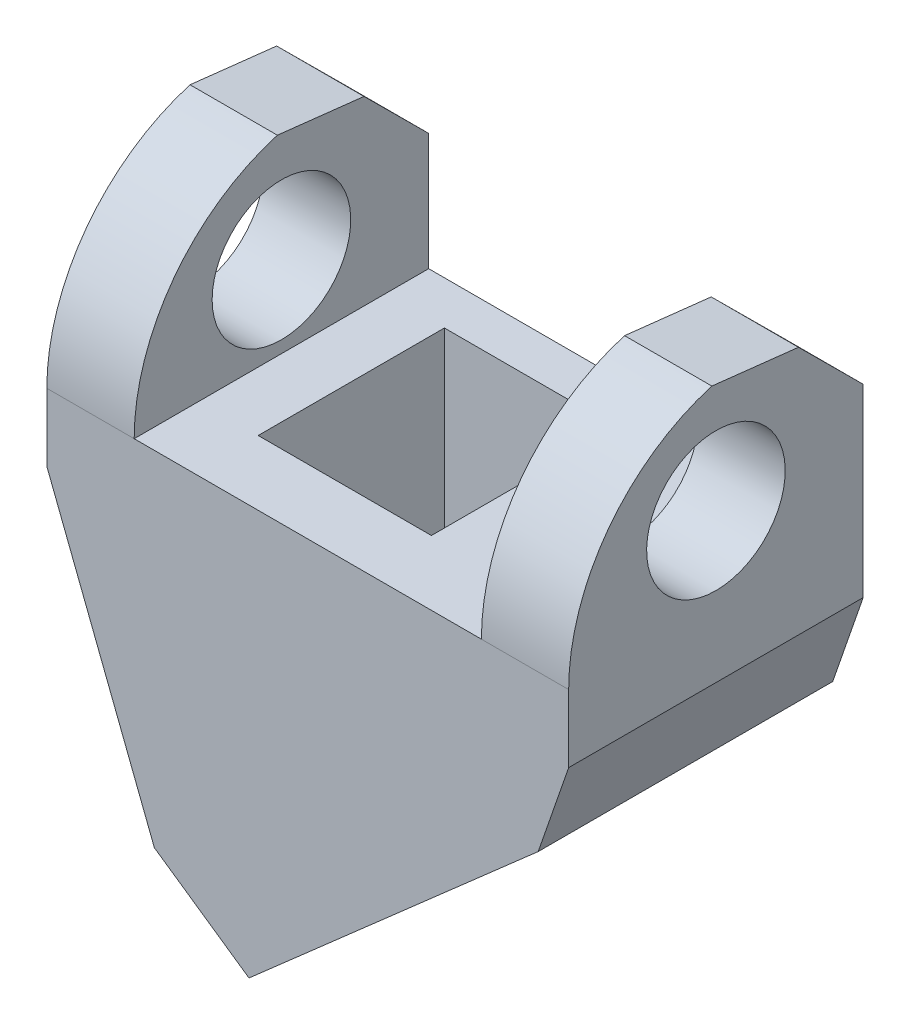
ISO-10303-21;
HEADER;
FILE_DESCRIPTION(('STEP AP214'),'2;1');
FILE_NAME('part.step','',(''),(''),'','','');
FILE_SCHEMA(('AUTOMOTIVE_DESIGN { 1 0 10303 214 1 1 1 1 }'));
ENDSEC;
DATA;
#1=APPLICATION_CONTEXT('core data for automotive mechanical design processes');
#2=APPLICATION_PROTOCOL_DEFINITION('international standard','automotive_design',2000,#1);
#3=PRODUCT_CONTEXT('',#1,'mechanical');
#4=PRODUCT('Part','Part','',(#3));
#5=PRODUCT_RELATED_PRODUCT_CATEGORY('part','',(#4));
#6=PRODUCT_DEFINITION_FORMATION('','',#4);
#7=PRODUCT_DEFINITION_CONTEXT('part definition',#1,'design');
#8=PRODUCT_DEFINITION('design','',#6,#7);
#9=PRODUCT_DEFINITION_SHAPE('','',#8);
#10=(LENGTH_UNIT() NAMED_UNIT(*) SI_UNIT(.MILLI.,.METRE.));
#11=(NAMED_UNIT(*) PLANE_ANGLE_UNIT() SI_UNIT($,.RADIAN.));
#12=(NAMED_UNIT(*) SI_UNIT($,.STERADIAN.) SOLID_ANGLE_UNIT());
#13=UNCERTAINTY_MEASURE_WITH_UNIT(LENGTH_MEASURE(1.E-05),#10,'distance_accuracy_value','');
#14=(GEOMETRIC_REPRESENTATION_CONTEXT(3) GLOBAL_UNCERTAINTY_ASSIGNED_CONTEXT((#13)) GLOBAL_UNIT_ASSIGNED_CONTEXT((#10,
#11,#12)) REPRESENTATION_CONTEXT('',''));
#15=CARTESIAN_POINT('',(0.,0.,0.));
#16=DIRECTION('',(0.,0.,1.));
#17=DIRECTION('',(1.,0.,0.));
#18=AXIS2_PLACEMENT_3D('',#15,#16,#17);
#19=CARTESIAN_POINT('',(-15.0393152654087,68.1555665634377,2.51494935882963));
#20=DIRECTION('',(0.,0.,1.));
#21=DIRECTION('',(0.,-1.,0.));
#22=AXIS2_PLACEMENT_3D('',#19,#20,#21);
#23=PLANE('',#22);
#24=DIRECTION('',(0.,-1.,0.));
#25=VECTOR('',#24,1.);
#26=CARTESIAN_POINT('',(-22.0839997464418,68.1555665634377,2.51494935882964));
#27=LINE('',#26,#25);
#28=CARTESIAN_POINT('',(-22.0839997464418,75.2475364005169,2.51494935882963));
#29=VERTEX_POINT('',#28);
#30=CARTESIAN_POINT('',(-22.0839997464418,73.4824145089119,2.51494935882963));
#31=VERTEX_POINT('',#30);
#32=EDGE_CURVE('E230',#29,#31,#27,.T.);
#33=ORIENTED_EDGE('',*,*,#32,.F.);
#34=DIRECTION('',(0.751257399724713,0.660009332781638,0.));
#35=VECTOR('',#34,1.);
#36=CARTESIAN_POINT('',(-23.163789117237,74.2988987399436,2.51494935882963));
#37=LINE('',#36,#35);
#38=CARTESIAN_POINT('',(-23.1637891172367,74.2988987399439,2.51494935882963));
#39=VERTEX_POINT('',#38);
#40=EDGE_CURVE('E264',#39,#29,#37,.T.);
#41=ORIENTED_EDGE('',*,*,#40,.F.);
#42=DIRECTION('',(-0.797638676251072,0.603135591843523,0.));
#43=VECTOR('',#42,1.);
#44=CARTESIAN_POINT('',(-15.0393152654087,68.1555665634377,2.51494935882963));
#45=LINE('',#44,#43);
#46=EDGE_CURVE('E259',#31,#39,#45,.T.);
#47=ORIENTED_EDGE('',*,*,#46,.F.);
#48=EDGE_LOOP('',(#33,#41,#47));
#49=FACE_BOUND('',#48,.T.);
#50=ADVANCED_FACE('F32',(#49),#23,.T.);
#51=CARTESIAN_POINT('',(-2.1795730675306,80.7846244199642,17.));
#52=DIRECTION('',(-0.660009332781638,0.751257399724713,0.));
#53=DIRECTION('',(-0.751257399724713,-0.660009332781638,0.));
#54=AXIS2_PLACEMENT_3D('',#51,#52,#53);
#55=PLANE('',#54);
#56=DIRECTION('',(0.751257399724713,0.660009332781638,0.));
#57=VECTOR('',#56,1.);
#58=CARTESIAN_POINT('',(-2.1795730675306,80.7846244199642,0.));
#59=LINE('',#58,#57);
#60=CARTESIAN_POINT('',(-18.8741251235288,66.1178002827174,0.));
#61=VERTEX_POINT('',#60);
#62=CARTESIAN_POINT('',(-2.1795730675306,80.7846244199642,0.));
#63=VERTEX_POINT('',#62);
#64=EDGE_CURVE('E338',#61,#63,#59,.T.);
#65=ORIENTED_EDGE('',*,*,#64,.T.);
#66=DIRECTION('',(0.,0.,-1.));
#67=VECTOR('',#66,1.);
#68=CARTESIAN_POINT('',(-2.1795730675306,80.7846244199642,17.));
#69=LINE('',#68,#67);
#70=CARTESIAN_POINT('',(-2.1795730675306,80.7846244199642,17.));
#71=VERTEX_POINT('',#70);
#72=EDGE_CURVE('E359',#71,#63,#69,.T.);
#73=ORIENTED_EDGE('',*,*,#72,.F.);
#74=DIRECTION('',(0.751257399724713,0.660009332781638,0.));
#75=VECTOR('',#74,1.);
#76=CARTESIAN_POINT('',(-2.1795730675306,80.7846244199642,17.));
#77=LINE('',#76,#75);
#78=CARTESIAN_POINT('',(-18.8741251235288,66.1178002827174,17.));
#79=VERTEX_POINT('',#78);
#80=EDGE_CURVE('E322',#79,#71,#77,.T.);
#81=ORIENTED_EDGE('',*,*,#80,.F.);
#82=DIRECTION('',(0.,0.,-1.));
#83=VECTOR('',#82,1.);
#84=CARTESIAN_POINT('',(-18.8741251235288,66.1178002827174,17.));
#85=LINE('',#84,#83);
#86=EDGE_CURVE('E362',#79,#61,#85,.T.);
#87=ORIENTED_EDGE('',*,*,#86,.T.);
#88=EDGE_LOOP('',(#65,#73,#81,#87));
#89=FACE_BOUND('',#88,.T.);
#90=DIRECTION('',(-0.751257399724713,-0.660009332781638,0.));
#91=VECTOR('',#90,1.);
#92=CARTESIAN_POINT('',(-15.6994059763522,68.9069165920742,2.51494935882963));
#93=LINE('',#92,#91);
#94=CARTESIAN_POINT('',(-8.73660731213499,75.0240105499464,2.51494935882963));
#95=VERTEX_POINT('',#94);
#96=CARTESIAN_POINT('',(-12.0839997464418,72.083193929791,2.51494935882963));
#97=VERTEX_POINT('',#96);
#98=EDGE_CURVE('E242',#95,#97,#93,.T.);
#99=ORIENTED_EDGE('',*,*,#98,.T.);
#100=DIRECTION('',(0.,0.,-1.));
#101=VECTOR('',#100,1.);
#102=CARTESIAN_POINT('',(-12.0839997464418,72.083193929791,17.));
#103=LINE('',#102,#101);
#104=CARTESIAN_POINT('',(-12.0839997464418,72.083193929791,2.51));
#105=VERTEX_POINT('',#104);
#106=EDGE_CURVE('E235',#97,#105,#103,.T.);
#107=ORIENTED_EDGE('',*,*,#106,.T.);
#108=DIRECTION('',(-0.751257399724713,-0.660009332781638,0.));
#109=VECTOR('',#108,1.);
#110=CARTESIAN_POINT('',(-2.1795730675306,80.7846244199642,2.51));
#111=LINE('',#110,#109);
#112=CARTESIAN_POINT('',(-15.8536990704591,68.7713640076582,2.51));
#113=VERTEX_POINT('',#112);
#114=EDGE_CURVE('E238',#105,#113,#111,.T.);
#115=ORIENTED_EDGE('',*,*,#114,.T.);
#116=DIRECTION('',(0.,0.,1.));
#117=VECTOR('',#116,1.);
#118=CARTESIAN_POINT('',(-15.8536990704591,68.7713640076582,13.2610917761324));
#119=LINE('',#118,#117);
#120=CARTESIAN_POINT('',(-15.8536990704591,68.7713640076582,13.2610917761324));
#121=VERTEX_POINT('',#120);
#122=EDGE_CURVE('E245',#113,#121,#119,.T.);
#123=ORIENTED_EDGE('',*,*,#122,.T.);
#124=DIRECTION('',(0.751257399724713,0.660009332781638,0.));
#125=VECTOR('',#124,1.);
#126=CARTESIAN_POINT('',(-8.58231421802809,75.1595631343624,13.2610917761324));
#127=LINE('',#126,#125);
#128=CARTESIAN_POINT('',(-8.73660731213499,75.0240105499464,13.2610917761324));
#129=VERTEX_POINT('',#128);
#130=EDGE_CURVE('E248',#121,#129,#127,.T.);
#131=ORIENTED_EDGE('',*,*,#130,.T.);
#132=DIRECTION('',(0.,0.,-1.));
#133=VECTOR('',#132,1.);
#134=CARTESIAN_POINT('',(-8.73660731213499,75.0240105499464,2.51494935882963));
#135=LINE('',#134,#133);
#136=EDGE_CURVE('E246',#129,#95,#135,.T.);
#137=ORIENTED_EDGE('',*,*,#136,.T.);
#138=EDGE_LOOP('',(#99,#107,#115,#123,#131,#137));
#139=FACE_BOUND('',#138,.T.);
#140=ADVANCED_FACE('F421',(#89,#139),#55,.F.);
#141=CARTESIAN_POINT('',(0.,0.,17.));
#142=DIRECTION('',(0.,0.,-1.));
#143=DIRECTION('',(-1.,0.,0.));
#144=AXIS2_PLACEMENT_3D('',#141,#142,#143);
#145=PLANE('',#144);
#146=DIRECTION('',(-1.,0.,0.));
#147=VECTOR('',#146,1.);
#148=CARTESIAN_POINT('',(18.4980253948452,89.7634252905846,17.));
#149=LINE('',#148,#147);
#150=CARTESIAN_POINT('',(-30.5439997464418,89.7634252905846,17.));
#151=VERTEX_POINT('',#150);
#152=CARTESIAN_POINT('',(-25.5019746051548,89.7634252905846,17.));
#153=VERTEX_POINT('',#152);
#154=EDGE_CURVE('E376',#151,#153,#149,.F.);
#155=ORIENTED_EDGE('',*,*,#154,.F.);
#156=DIRECTION('',(0.,-1.,0.));
#157=VECTOR('',#156,1.);
#158=CARTESIAN_POINT('',(-30.5439997464418,85.8614227175712,17.));
#159=LINE('',#158,#157);
#160=CARTESIAN_POINT('',(-30.5439997464418,85.8614227175712,17.));
#161=VERTEX_POINT('',#160);
#162=EDGE_CURVE('E315',#151,#161,#159,.T.);
#163=ORIENTED_EDGE('',*,*,#162,.T.);
#164=DIRECTION('',(0.362427694111266,-0.932011891845373,0.));
#165=VECTOR('',#164,1.);
#166=CARTESIAN_POINT('',(-24.3369525661396,69.899502921478,17.));
#167=LINE('',#166,#165);
#168=CARTESIAN_POINT('',(-24.3369525661396,69.899502921478,17.));
#169=VERTEX_POINT('',#168);
#170=EDGE_CURVE('E317',#161,#169,#167,.T.);
#171=ORIENTED_EDGE('',*,*,#170,.T.);
#172=DIRECTION('',(0.822210140525287,-0.569184051794661,0.));
#173=VECTOR('',#172,1.);
#174=CARTESIAN_POINT('',(-18.8741251235288,66.1178002827174,17.));
#175=LINE('',#174,#173);
#176=EDGE_CURVE('E320',#169,#79,#175,.T.);
#177=ORIENTED_EDGE('',*,*,#176,.T.);
#178=ORIENTED_EDGE('',*,*,#80,.T.);
#179=DIRECTION('',(0.327290063128933,0.944923919994123,0.));
#180=VECTOR('',#179,1.);
#181=CARTESIAN_POINT('',(-0.421139822103817,85.8614227175712,17.));
#182=LINE('',#181,#180);
#183=CARTESIAN_POINT('',(-0.421139822103817,85.8614227175712,17.));
#184=VERTEX_POINT('',#183);
#185=EDGE_CURVE('E324',#71,#184,#182,.T.);
#186=ORIENTED_EDGE('',*,*,#185,.T.);
#187=DIRECTION('',(0.,1.,0.));
#188=VECTOR('',#187,1.);
#189=CARTESIAN_POINT('',(-0.421139822103861,100.861422717571,17.));
#190=LINE('',#189,#188);
#191=CARTESIAN_POINT('',(-0.421139822103841,89.7634252905846,17.));
#192=VERTEX_POINT('',#191);
#193=EDGE_CURVE('E326',#184,#192,#190,.T.);
#194=ORIENTED_EDGE('',*,*,#193,.T.);
#195=CARTESIAN_POINT('',(-5.45945062258354,89.7634252905846,17.));
#196=VERTEX_POINT('',#195);
#197=EDGE_CURVE('E374',#196,#192,#149,.F.);
#198=ORIENTED_EDGE('',*,*,#197,.F.);
#199=DIRECTION('',(-1.,0.,0.));
#200=VECTOR('',#199,1.);
#201=CARTESIAN_POINT('',(-25.5019746051548,89.7634252905846,17.));
#202=LINE('',#201,#200);
#203=EDGE_CURVE('E329',#196,#153,#202,.T.);
#204=ORIENTED_EDGE('',*,*,#203,.T.);
#205=EDGE_LOOP('',(#155,#163,#171,#177,#178,#186,#194,#198,#204));
#206=FACE_BOUND('',#205,.T.);
#207=ADVANCED_FACE('F390',(#206),#145,.F.);
#208=CARTESIAN_POINT('',(-30.5439997464418,85.8614227175712,17.));
#209=DIRECTION('',(1.,0.,0.));
#210=DIRECTION('',(0.,1.,0.));
#211=AXIS2_PLACEMENT_3D('',#208,#209,#210);
#212=PLANE('',#211);
#213=CARTESIAN_POINT('',(-30.5439997464418,94.4592808428831,8.5));
#214=DIRECTION('',(-1.,0.,0.));
#215=DIRECTION('',(0.,-1.,0.));
#216=AXIS2_PLACEMENT_3D('',#213,#214,#215);
#217=CIRCLE('',#216,4.);
#218=CARTESIAN_POINT('',(-30.5439997464418,90.4592808428831,8.5));
#219=VERTEX_POINT('',#218);
#220=EDGE_CURVE('E507',#219,#219,#217,.T.);
#221=ORIENTED_EDGE('',*,*,#220,.F.);
#222=EDGE_LOOP('',(#221));
#223=FACE_BOUND('',#222,.T.);
#224=ORIENTED_EDGE('',*,*,#162,.F.);
#225=CARTESIAN_POINT('',(-30.5439997464418,89.7634252905846,5.49450288206386));
#226=DIRECTION('',(1.,0.,0.));
#227=DIRECTION('',(0.,1.,0.));
#228=AXIS2_PLACEMENT_3D('',#225,#226,#227);
#229=CIRCLE('',#228,11.5054971179361);
#230=CARTESIAN_POINT('',(-30.5439997464418,100.803448871588,8.73400026001036));
#231=VERTEX_POINT('',#230);
#232=EDGE_CURVE('E302',#151,#231,#229,.F.);
#233=ORIENTED_EDGE('',*,*,#232,.T.);
#234=DIRECTION('',(0.,-0.111700323808087,-0.9937419371553));
#235=VECTOR('',#234,1.);
#236=CARTESIAN_POINT('',(-30.5439997464418,101.534554459212,15.2382811621701));
#237=LINE('',#236,#235);
#238=CARTESIAN_POINT('',(-30.5439997464418,100.241430103779,3.73400026001036));
#239=VERTEX_POINT('',#238);
#240=EDGE_CURVE('E311',#231,#239,#237,.T.);
#241=ORIENTED_EDGE('',*,*,#240,.T.);
#242=DIRECTION('',(0.,-0.705206396881613,-0.709002071786291));
#243=VECTOR('',#242,1.);
#244=CARTESIAN_POINT('',(-30.5439997464418,99.7229257634078,3.21270514246909));
#245=LINE('',#244,#243);
#246=CARTESIAN_POINT('',(-30.5439997464418,96.5274199843407,0.));
#247=VERTEX_POINT('',#246);
#248=EDGE_CURVE('E290',#239,#247,#245,.T.);
#249=ORIENTED_EDGE('',*,*,#248,.T.);
#250=DIRECTION('',(0.,-1.,0.));
#251=VECTOR('',#250,1.);
#252=CARTESIAN_POINT('',(-30.5439997464418,85.8614227175712,0.));
#253=LINE('',#252,#251);
#254=CARTESIAN_POINT('',(-30.5439997464418,85.8614227175712,0.));
#255=VERTEX_POINT('',#254);
#256=EDGE_CURVE('E314',#247,#255,#253,.T.);
#257=ORIENTED_EDGE('',*,*,#256,.T.);
#258=DIRECTION('',(0.,0.,-1.));
#259=VECTOR('',#258,1.);
#260=CARTESIAN_POINT('',(-30.5439997464418,85.8614227175712,17.));
#261=LINE('',#260,#259);
#262=EDGE_CURVE('E368',#161,#255,#261,.T.);
#263=ORIENTED_EDGE('',*,*,#262,.F.);
#264=EDGE_LOOP('',(#224,#233,#241,#249,#257,#263));
#265=FACE_BOUND('',#264,.T.);
#266=ADVANCED_FACE('F34',(#223,#265),#212,.F.);
#267=CARTESIAN_POINT('',(-24.3369525661396,69.899502921478,17.));
#268=DIRECTION('',(0.932011891845373,0.362427694111266,0.));
#269=DIRECTION('',(-0.362427694111266,0.932011891845373,0.));
#270=AXIS2_PLACEMENT_3D('',#267,#268,#269);
#271=PLANE('',#270);
#272=DIRECTION('',(0.362427694111266,-0.932011891845373,0.));
#273=VECTOR('',#272,1.);
#274=CARTESIAN_POINT('',(-24.3369525661396,69.899502921478,0.));
#275=LINE('',#274,#273);
#276=CARTESIAN_POINT('',(-24.3369525661396,69.899502921478,0.));
#277=VERTEX_POINT('',#276);
#278=EDGE_CURVE('E334',#255,#277,#275,.T.);
#279=ORIENTED_EDGE('',*,*,#278,.T.);
#280=DIRECTION('',(0.,0.,-1.));
#281=VECTOR('',#280,1.);
#282=CARTESIAN_POINT('',(-24.3369525661396,69.899502921478,17.));
#283=LINE('',#282,#281);
#284=EDGE_CURVE('E365',#169,#277,#283,.T.);
#285=ORIENTED_EDGE('',*,*,#284,.F.);
#286=ORIENTED_EDGE('',*,*,#170,.F.);
#287=ORIENTED_EDGE('',*,*,#262,.T.);
#288=EDGE_LOOP('',(#279,#285,#286,#287));
#289=FACE_BOUND('',#288,.T.);
#290=ADVANCED_FACE('F409',(#289),#271,.F.);
#291=CARTESIAN_POINT('',(-18.8741251235288,66.1178002827174,17.));
#292=DIRECTION('',(0.569184051794661,0.822210140525287,0.));
#293=DIRECTION('',(-0.822210140525287,0.569184051794661,0.));
#294=AXIS2_PLACEMENT_3D('',#291,#292,#293);
#295=PLANE('',#294);
#296=DIRECTION('',(0.822210140525287,-0.569184051794661,0.));
#297=VECTOR('',#296,1.);
#298=CARTESIAN_POINT('',(-18.8741251235288,66.1178002827174,0.));
#299=LINE('',#298,#297);
#300=EDGE_CURVE('E336',#277,#61,#299,.T.);
#301=ORIENTED_EDGE('',*,*,#300,.T.);
#302=ORIENTED_EDGE('',*,*,#86,.F.);
#303=ORIENTED_EDGE('',*,*,#176,.F.);
#304=ORIENTED_EDGE('',*,*,#284,.T.);
#305=EDGE_LOOP('',(#301,#302,#303,#304));
#306=FACE_BOUND('',#305,.T.);
#307=ADVANCED_FACE('F415',(#306),#295,.F.);
#308=CARTESIAN_POINT('',(-0.421139822103817,85.8614227175712,17.));
#309=DIRECTION('',(-0.944923919994123,0.327290063128933,0.));
#310=DIRECTION('',(-0.327290063128933,-0.944923919994123,0.));
#311=AXIS2_PLACEMENT_3D('',#308,#309,#310);
#312=PLANE('',#311);
#313=DIRECTION('',(0.327290063128933,0.944923919994123,0.));
#314=VECTOR('',#313,1.);
#315=CARTESIAN_POINT('',(-0.421139822103817,85.8614227175712,0.));
#316=LINE('',#315,#314);
#317=CARTESIAN_POINT('',(-0.421139822103817,85.8614227175712,0.));
#318=VERTEX_POINT('',#317);
#319=EDGE_CURVE('E340',#63,#318,#316,.T.);
#320=ORIENTED_EDGE('',*,*,#319,.T.);
#321=DIRECTION('',(0.,0.,-1.));
#322=VECTOR('',#321,1.);
#323=CARTESIAN_POINT('',(-0.421139822103817,85.8614227175712,17.));
#324=LINE('',#323,#322);
#325=EDGE_CURVE('E356',#184,#318,#324,.T.);
#326=ORIENTED_EDGE('',*,*,#325,.F.);
#327=ORIENTED_EDGE('',*,*,#185,.F.);
#328=ORIENTED_EDGE('',*,*,#72,.T.);
#329=EDGE_LOOP('',(#320,#326,#327,#328));
#330=FACE_BOUND('',#329,.T.);
#331=ADVANCED_FACE('F426',(#330),#312,.F.);
#332=CARTESIAN_POINT('',(-0.421139822103861,100.861422717571,17.));
#333=DIRECTION('',(-1.,0.,0.));
#334=DIRECTION('',(0.,-1.,0.));
#335=AXIS2_PLACEMENT_3D('',#332,#333,#334);
#336=PLANE('',#335);
#337=CARTESIAN_POINT('',(-0.421139822103817,94.4592808428831,8.5));
#338=DIRECTION('',(-1.,0.,0.));
#339=DIRECTION('',(0.,-1.,0.));
#340=AXIS2_PLACEMENT_3D('',#337,#338,#339);
#341=CIRCLE('',#340,4.);
#342=CARTESIAN_POINT('',(-0.421139822103816,90.4592808428831,8.5));
#343=VERTEX_POINT('',#342);
#344=EDGE_CURVE('E503',#343,#343,#341,.T.);
#345=ORIENTED_EDGE('',*,*,#344,.T.);
#346=EDGE_LOOP('',(#345));
#347=FACE_BOUND('',#346,.T.);
#348=DIRECTION('',(0.,0.111700323808087,0.9937419371553));
#349=VECTOR('',#348,1.);
#350=CARTESIAN_POINT('',(-0.421139822103864,101.721708894294,16.903300604599));
#351=LINE('',#350,#349);
#352=CARTESIAN_POINT('',(-0.421139822103855,100.241430103779,3.73400026001036));
#353=VERTEX_POINT('',#352);
#354=CARTESIAN_POINT('',(-0.421139822103862,100.803448871588,8.73400026001036));
#355=VERTEX_POINT('',#354);
#356=EDGE_CURVE('E308',#353,#355,#351,.T.);
#357=ORIENTED_EDGE('',*,*,#356,.T.);
#358=CARTESIAN_POINT('',(-0.42113982210383,89.7634252905846,5.49450288206386));
#359=DIRECTION('',(-1.,0.,0.));
#360=DIRECTION('',(0.,-1.,0.));
#361=AXIS2_PLACEMENT_3D('',#358,#359,#360);
#362=CIRCLE('',#361,11.5054971179361);
#363=EDGE_CURVE('E299',#355,#192,#362,.F.);
#364=ORIENTED_EDGE('',*,*,#363,.T.);
#365=ORIENTED_EDGE('',*,*,#193,.F.);
#366=ORIENTED_EDGE('',*,*,#325,.T.);
#367=DIRECTION('',(0.,1.,0.));
#368=VECTOR('',#367,1.);
#369=CARTESIAN_POINT('',(-0.421139822103861,100.861422717571,0.));
#370=LINE('',#369,#368);
#371=CARTESIAN_POINT('',(-0.421139822103848,96.5274199843407,0.));
#372=VERTEX_POINT('',#371);
#373=EDGE_CURVE('E342',#318,#372,#370,.T.);
#374=ORIENTED_EDGE('',*,*,#373,.T.);
#375=DIRECTION('',(0.,0.705206396881613,0.709002071786291));
#376=VECTOR('',#375,1.);
#377=CARTESIAN_POINT('',(-0.42113982210388,107.182666696449,10.7125970888592));
#378=LINE('',#377,#376);
#379=EDGE_CURVE('E287',#372,#353,#378,.T.);
#380=ORIENTED_EDGE('',*,*,#379,.T.);
#381=EDGE_LOOP('',(#357,#364,#365,#366,#374,#380));
#382=FACE_BOUND('',#381,.T.);
#383=ADVANCED_FACE('F430',(#347,#382),#336,.F.);
#384=CARTESIAN_POINT('',(-5.45945062258354,89.7634252905846,17.));
#385=DIRECTION('',(1.,0.,0.));
#386=DIRECTION('',(0.,1.,0.));
#387=AXIS2_PLACEMENT_3D('',#384,#385,#386);
#388=PLANE('',#387);
#389=CARTESIAN_POINT('',(-5.45945062258354,94.4592808428831,8.5));
#390=DIRECTION('',(1.,0.,0.));
#391=DIRECTION('',(0.,1.,0.));
#392=AXIS2_PLACEMENT_3D('',#389,#390,#391);
#393=CIRCLE('',#392,4.);
#394=CARTESIAN_POINT('',(-5.45945062258354,98.4592808428831,8.5));
#395=VERTEX_POINT('',#394);
#396=EDGE_CURVE('E497',#395,#395,#393,.T.);
#397=ORIENTED_EDGE('',*,*,#396,.T.);
#398=EDGE_LOOP('',(#397));
#399=FACE_BOUND('',#398,.T.);
#400=DIRECTION('',(0.,0.,-1.));
#401=VECTOR('',#400,1.);
#402=CARTESIAN_POINT('',(-5.45945062258354,89.7634252905846,17.));
#403=LINE('',#402,#401);
#404=CARTESIAN_POINT('',(-5.45945062258354,89.7634252905846,0.));
#405=VERTEX_POINT('',#404);
#406=EDGE_CURVE('E353',#196,#405,#403,.T.);
#407=ORIENTED_EDGE('',*,*,#406,.F.);
#408=CARTESIAN_POINT('',(-5.45945062258354,89.7634252905846,5.49450288206386));
#409=DIRECTION('',(1.,0.,0.));
#410=DIRECTION('',(0.,1.,0.));
#411=AXIS2_PLACEMENT_3D('',#408,#409,#410);
#412=CIRCLE('',#411,11.5054971179361);
#413=CARTESIAN_POINT('',(-5.45945062258354,100.803448871588,8.73400026001036));
#414=VERTEX_POINT('',#413);
#415=EDGE_CURVE('E296',#196,#414,#412,.F.);
#416=ORIENTED_EDGE('',*,*,#415,.T.);
#417=DIRECTION('',(0.,-0.111700323808087,-0.9937419371553));
#418=VECTOR('',#417,1.);
#419=CARTESIAN_POINT('',(-5.45945062258354,101.583239598361,15.6714085054018));
#420=LINE('',#419,#418);
#421=CARTESIAN_POINT('',(-5.45945062258354,100.241430103779,3.73400026001036));
#422=VERTEX_POINT('',#421);
#423=EDGE_CURVE('E305',#414,#422,#420,.T.);
#424=ORIENTED_EDGE('',*,*,#423,.T.);
#425=DIRECTION('',(0.,-0.705206396881613,-0.709002071786291));
#426=VECTOR('',#425,1.);
#427=CARTESIAN_POINT('',(-5.45945062258354,101.663454317724,5.1636783206115));
#428=LINE('',#427,#426);
#429=CARTESIAN_POINT('',(-5.45945062258354,96.5274199843407,0.));
#430=VERTEX_POINT('',#429);
#431=EDGE_CURVE('E284',#422,#430,#428,.T.);
#432=ORIENTED_EDGE('',*,*,#431,.T.);
#433=DIRECTION('',(0.,-1.,0.));
#434=VECTOR('',#433,1.);
#435=CARTESIAN_POINT('',(-5.45945062258354,89.7634252905846,0.));
#436=LINE('',#435,#434);
#437=EDGE_CURVE('E345',#430,#405,#436,.T.);
#438=ORIENTED_EDGE('',*,*,#437,.T.);
#439=EDGE_LOOP('',(#407,#416,#424,#432,#438));
#440=FACE_BOUND('',#439,.T.);
#441=ADVANCED_FACE('F440',(#399,#440),#388,.F.);
#442=CARTESIAN_POINT('',(-25.5019746051548,89.7634252905846,17.));
#443=DIRECTION('',(0.,-1.,0.));
#444=DIRECTION('',(0.,0.,-1.));
#445=AXIS2_PLACEMENT_3D('',#442,#443,#444);
#446=PLANE('',#445);
#447=DIRECTION('',(1.,0.,0.));
#448=VECTOR('',#447,1.);
#449=CARTESIAN_POINT('',(-22.0839997464418,89.7634252905846,13.26));
#450=LINE('',#449,#448);
#451=CARTESIAN_POINT('',(-22.0839997464418,89.7634252905846,13.26));
#452=VERTEX_POINT('',#451);
#453=CARTESIAN_POINT('',(-12.0839997464418,89.7634252905846,13.26));
#454=VERTEX_POINT('',#453);
#455=EDGE_CURVE('E209',#452,#454,#450,.T.);
#456=ORIENTED_EDGE('',*,*,#455,.F.);
#457=DIRECTION('',(0.,0.,1.));
#458=VECTOR('',#457,1.);
#459=CARTESIAN_POINT('',(-22.0839997464418,89.7634252905846,2.51));
#460=LINE('',#459,#458);
#461=CARTESIAN_POINT('',(-22.0839997464418,89.7634252905846,2.51));
#462=VERTEX_POINT('',#461);
#463=EDGE_CURVE('E48',#462,#452,#460,.T.);
#464=ORIENTED_EDGE('',*,*,#463,.F.);
#465=DIRECTION('',(-1.,0.,0.));
#466=VECTOR('',#465,1.);
#467=CARTESIAN_POINT('',(-22.0839997464418,89.7634252905846,2.51));
#468=LINE('',#467,#466);
#469=CARTESIAN_POINT('',(-12.0839997464418,89.7634252905846,2.51));
#470=VERTEX_POINT('',#469);
#471=EDGE_CURVE('E216',#470,#462,#468,.T.);
#472=ORIENTED_EDGE('',*,*,#471,.F.);
#473=DIRECTION('',(0.,0.,-1.));
#474=VECTOR('',#473,1.);
#475=CARTESIAN_POINT('',(-12.0839997464418,89.7634252905846,2.51));
#476=LINE('',#475,#474);
#477=EDGE_CURVE('E199',#454,#470,#476,.T.);
#478=ORIENTED_EDGE('',*,*,#477,.F.);
#479=EDGE_LOOP('',(#456,#464,#472,#478));
#480=FACE_BOUND('',#479,.T.);
#481=DIRECTION('',(-1.,0.,0.));
#482=VECTOR('',#481,1.);
#483=CARTESIAN_POINT('',(-25.5019746051548,89.7634252905846,0.));
#484=LINE('',#483,#482);
#485=CARTESIAN_POINT('',(-25.5019746051548,89.7634252905846,0.));
#486=VERTEX_POINT('',#485);
#487=EDGE_CURVE('E347',#405,#486,#484,.T.);
#488=ORIENTED_EDGE('',*,*,#487,.T.);
#489=DIRECTION('',(0.,0.,-1.));
#490=VECTOR('',#489,1.);
#491=CARTESIAN_POINT('',(-25.5019746051548,89.7634252905846,17.));
#492=LINE('',#491,#490);
#493=EDGE_CURVE('E332',#153,#486,#492,.T.);
#494=ORIENTED_EDGE('',*,*,#493,.F.);
#495=ORIENTED_EDGE('',*,*,#203,.F.);
#496=ORIENTED_EDGE('',*,*,#406,.T.);
#497=EDGE_LOOP('',(#488,#494,#495,#496));
#498=FACE_BOUND('',#497,.T.);
#499=ADVANCED_FACE('F213',(#480,#498),#446,.F.);
#500=CARTESIAN_POINT('',(-25.5019746051548,100.861422717571,17.));
#501=DIRECTION('',(-1.,0.,0.));
#502=DIRECTION('',(0.,0.,1.));
#503=AXIS2_PLACEMENT_3D('',#500,#501,#502);
#504=PLANE('',#503);
#505=CARTESIAN_POINT('',(-25.5019746051548,94.4592808428831,8.5));
#506=DIRECTION('',(-1.,0.,0.));
#507=DIRECTION('',(0.,0.,1.));
#508=AXIS2_PLACEMENT_3D('',#505,#506,#507);
#509=CIRCLE('',#508,4.);
#510=CARTESIAN_POINT('',(-25.5019746051548,94.4592808428831,12.5));
#511=VERTEX_POINT('',#510);
#512=EDGE_CURVE('E36',#511,#511,#509,.T.);
#513=ORIENTED_EDGE('',*,*,#512,.T.);
#514=EDGE_LOOP('',(#513));
#515=FACE_BOUND('',#514,.T.);
#516=DIRECTION('',(0.,0.111700323808087,0.9937419371553));
#517=VECTOR('',#516,1.);
#518=CARTESIAN_POINT('',(-25.5019746051548,101.721708894294,16.903300604599));
#519=LINE('',#518,#517);
#520=CARTESIAN_POINT('',(-25.5019746051548,100.241430103779,3.73400026001036));
#521=VERTEX_POINT('',#520);
#522=CARTESIAN_POINT('',(-25.5019746051548,100.803448871588,8.73400026001036));
#523=VERTEX_POINT('',#522);
#524=EDGE_CURVE('E41',#521,#523,#519,.T.);
#525=ORIENTED_EDGE('',*,*,#524,.T.);
#526=CARTESIAN_POINT('',(-25.5019746051548,89.7634252905846,5.49450288206386));
#527=DIRECTION('',(-1.,0.,0.));
#528=DIRECTION('',(0.,0.,1.));
#529=AXIS2_PLACEMENT_3D('',#526,#527,#528);
#530=CIRCLE('',#529,11.5054971179361);
#531=EDGE_CURVE('E293',#523,#153,#530,.F.);
#532=ORIENTED_EDGE('',*,*,#531,.T.);
#533=ORIENTED_EDGE('',*,*,#493,.T.);
#534=DIRECTION('',(0.,1.,0.));
#535=VECTOR('',#534,1.);
#536=CARTESIAN_POINT('',(-25.5019746051548,100.861422717571,0.));
#537=LINE('',#536,#535);
#538=CARTESIAN_POINT('',(-25.5019746051548,96.5274199843407,0.));
#539=VERTEX_POINT('',#538);
#540=EDGE_CURVE('E318',#486,#539,#537,.T.);
#541=ORIENTED_EDGE('',*,*,#540,.T.);
#542=DIRECTION('',(0.,0.705206396881613,0.709002071786291));
#543=VECTOR('',#542,1.);
#544=CARTESIAN_POINT('',(-25.5019746051548,107.182666696449,10.7125970888592));
#545=LINE('',#544,#543);
#546=EDGE_CURVE('E281',#539,#521,#545,.T.);
#547=ORIENTED_EDGE('',*,*,#546,.T.);
#548=EDGE_LOOP('',(#525,#532,#533,#541,#547));
#549=FACE_BOUND('',#548,.T.);
#550=ADVANCED_FACE('F385',(#515,#549),#504,.F.);
#551=CARTESIAN_POINT('',(0.,0.,0.));
#552=DIRECTION('',(0.,0.,-1.));
#553=DIRECTION('',(-1.,0.,0.));
#554=AXIS2_PLACEMENT_3D('',#551,#552,#553);
#555=PLANE('',#554);
#556=DIRECTION('',(-1.,0.,0.));
#557=VECTOR('',#556,1.);
#558=CARTESIAN_POINT('',(0.,96.5274199843407,0.));
#559=LINE('',#558,#557);
#560=EDGE_CURVE('E373',#372,#430,#559,.T.);
#561=ORIENTED_EDGE('',*,*,#560,.F.);
#562=ORIENTED_EDGE('',*,*,#373,.F.);
#563=ORIENTED_EDGE('',*,*,#319,.F.);
#564=ORIENTED_EDGE('',*,*,#64,.F.);
#565=ORIENTED_EDGE('',*,*,#300,.F.);
#566=ORIENTED_EDGE('',*,*,#278,.F.);
#567=ORIENTED_EDGE('',*,*,#256,.F.);
#568=EDGE_CURVE('E371',#539,#247,#559,.T.);
#569=ORIENTED_EDGE('',*,*,#568,.F.);
#570=ORIENTED_EDGE('',*,*,#540,.F.);
#571=ORIENTED_EDGE('',*,*,#487,.F.);
#572=ORIENTED_EDGE('',*,*,#437,.F.);
#573=EDGE_LOOP('',(#561,#562,#563,#564,#565,#566,#567,#569,#570,#571,#572));
#574=FACE_BOUND('',#573,.T.);
#575=ADVANCED_FACE('F396',(#574),#555,.T.);
#576=CARTESIAN_POINT('',(18.4980253948452,48.5227835831376,-48.2630146497583));
#577=DIRECTION('',(0.,-0.709002071786291,0.705206396881613));
#578=DIRECTION('',(0.,-0.705206396881613,-0.709002071786291));
#579=AXIS2_PLACEMENT_3D('',#576,#577,#578);
#580=PLANE('',#579);
#581=DIRECTION('',(-1.,0.,0.));
#582=VECTOR('',#581,1.);
#583=CARTESIAN_POINT('',(18.4980253948452,100.241430103779,3.73400026001036));
#584=LINE('',#583,#582);
#585=EDGE_CURVE('E251',#521,#239,#584,.T.);
#586=ORIENTED_EDGE('',*,*,#585,.F.);
#587=ORIENTED_EDGE('',*,*,#546,.F.);
#588=ORIENTED_EDGE('',*,*,#568,.T.);
#589=ORIENTED_EDGE('',*,*,#248,.F.);
#590=EDGE_LOOP('',(#586,#587,#588,#589));
#591=FACE_BOUND('',#590,.T.);
#592=ADVANCED_FACE('F401',(#591),#580,.F.);
#593=CARTESIAN_POINT('',(18.4980253948452,89.7634252905846,5.49450288206386));
#594=DIRECTION('',(-1.,0.,0.));
#595=DIRECTION('',(0.,0.,1.));
#596=AXIS2_PLACEMENT_3D('',#593,#594,#595);
#597=CYLINDRICAL_SURFACE('',#596,11.5054971179361);
#598=ORIENTED_EDGE('',*,*,#154,.T.);
#599=ORIENTED_EDGE('',*,*,#531,.F.);
#600=DIRECTION('',(-1.,0.,0.));
#601=VECTOR('',#600,1.);
#602=CARTESIAN_POINT('',(18.4980253948452,100.803448871588,8.73400026001036));
#603=LINE('',#602,#601);
#604=EDGE_CURVE('E277',#523,#231,#603,.T.);
#605=ORIENTED_EDGE('',*,*,#604,.T.);
#606=ORIENTED_EDGE('',*,*,#232,.F.);
#607=EDGE_LOOP('',(#598,#599,#605,#606));
#608=FACE_BOUND('',#607,.T.);
#609=ADVANCED_FACE('F381',(#608),#597,.T.);
#610=CARTESIAN_POINT('',(18.4980253948452,98.5762426868533,-11.0803396900269));
#611=DIRECTION('',(0.,-0.9937419371553,0.111700323808087));
#612=DIRECTION('',(0.,-0.111700323808087,-0.9937419371553));
#613=AXIS2_PLACEMENT_3D('',#610,#611,#612);
#614=PLANE('',#613);
#615=ORIENTED_EDGE('',*,*,#604,.F.);
#616=ORIENTED_EDGE('',*,*,#524,.F.);
#617=ORIENTED_EDGE('',*,*,#585,.T.);
#618=ORIENTED_EDGE('',*,*,#240,.F.);
#619=EDGE_LOOP('',(#615,#616,#617,#618));
#620=FACE_BOUND('',#619,.T.);
#621=ADVANCED_FACE('F403',(#620),#614,.F.);
#622=EDGE_CURVE('E276',#353,#422,#584,.T.);
#623=ORIENTED_EDGE('',*,*,#622,.T.);
#624=ORIENTED_EDGE('',*,*,#423,.F.);
#625=EDGE_CURVE('E280',#355,#414,#603,.T.);
#626=ORIENTED_EDGE('',*,*,#625,.F.);
#627=ORIENTED_EDGE('',*,*,#356,.F.);
#628=EDGE_LOOP('',(#623,#624,#626,#627));
#629=FACE_BOUND('',#628,.T.);
#630=ADVANCED_FACE('F437',(#629),#614,.F.);
#631=ORIENTED_EDGE('',*,*,#625,.T.);
#632=ORIENTED_EDGE('',*,*,#415,.F.);
#633=ORIENTED_EDGE('',*,*,#197,.T.);
#634=ORIENTED_EDGE('',*,*,#363,.F.);
#635=EDGE_LOOP('',(#631,#632,#633,#634));
#636=FACE_BOUND('',#635,.T.);
#637=ADVANCED_FACE('F434',(#636),#597,.T.);
#638=ORIENTED_EDGE('',*,*,#560,.T.);
#639=ORIENTED_EDGE('',*,*,#431,.F.);
#640=ORIENTED_EDGE('',*,*,#622,.F.);
#641=ORIENTED_EDGE('',*,*,#379,.F.);
#642=EDGE_LOOP('',(#638,#639,#640,#641));
#643=FACE_BOUND('',#642,.T.);
#644=ADVANCED_FACE('F442',(#643),#580,.F.);
#645=CARTESIAN_POINT('',(-48.3155362733478,52.2020942826695,0.));
#646=DIRECTION('',(0.660009332781638,-0.751257399724713,0.));
#647=DIRECTION('',(0.751257399724713,0.660009332781638,0.));
#648=AXIS2_PLACEMENT_3D('',#645,#646,#647);
#649=PLANE('',#648);
#650=DIRECTION('',(0.,0.,-1.));
#651=VECTOR('',#650,1.);
#652=CARTESIAN_POINT('',(-22.0839997464418,75.2475364005169,0.));
#653=LINE('',#652,#651);
#654=CARTESIAN_POINT('',(-22.0839997464418,75.2475364005169,13.26));
#655=VERTEX_POINT('',#654);
#656=EDGE_CURVE('E232',#655,#29,#653,.T.);
#657=ORIENTED_EDGE('',*,*,#656,.F.);
#658=DIRECTION('',(-0.751257399724713,-0.660009332781638,0.));
#659=VECTOR('',#658,1.);
#660=CARTESIAN_POINT('',(-48.3155362733478,52.2020942826695,13.26));
#661=LINE('',#660,#659);
#662=CARTESIAN_POINT('',(-16.0466973589124,80.5515452822325,13.26));
#663=VERTEX_POINT('',#662);
#664=EDGE_CURVE('E228',#663,#655,#661,.T.);
#665=ORIENTED_EDGE('',*,*,#664,.F.);
#666=DIRECTION('',(0.,0.,1.));
#667=VECTOR('',#666,1.);
#668=CARTESIAN_POINT('',(-16.0466973589129,80.5515452822318,2.51494935882963));
#669=LINE('',#668,#667);
#670=CARTESIAN_POINT('',(-16.0466973589127,80.5515452822322,13.2610917761324));
#671=VERTEX_POINT('',#670);
#672=EDGE_CURVE('E268',#663,#671,#669,.T.);
#673=ORIENTED_EDGE('',*,*,#672,.T.);
#674=DIRECTION('',(-0.751257399724713,-0.660009332781638,0.));
#675=VECTOR('',#674,1.);
#676=CARTESIAN_POINT('',(-16.0466973589129,80.5515452822318,13.2610917761324));
#677=LINE('',#676,#675);
#678=CARTESIAN_POINT('',(-23.1637891172367,74.2988987399439,13.2610917761324));
#679=VERTEX_POINT('',#678);
#680=EDGE_CURVE('E252',#671,#679,#677,.T.);
#681=ORIENTED_EDGE('',*,*,#680,.T.);
#682=DIRECTION('',(0.,0.,-1.));
#683=VECTOR('',#682,1.);
#684=CARTESIAN_POINT('',(-23.163789117237,74.2988987399436,13.2610917761324));
#685=LINE('',#684,#683);
#686=EDGE_CURVE('E255',#679,#39,#685,.T.);
#687=ORIENTED_EDGE('',*,*,#686,.T.);
#688=ORIENTED_EDGE('',*,*,#40,.T.);
#689=EDGE_LOOP('',(#657,#665,#673,#681,#687,#688));
#690=FACE_BOUND('',#689,.T.);
#691=ADVANCED_FACE('F444',(#690),#649,.T.);
#692=CARTESIAN_POINT('',(-7.92222350708465,74.4082131057259,2.51494935882963));
#693=DIRECTION('',(-0.603135591843523,-0.797638676251072,0.));
#694=DIRECTION('',(0.797638676251072,-0.603135591843523,0.));
#695=AXIS2_PLACEMENT_3D('',#692,#693,#694);
#696=PLANE('',#695);
#697=DIRECTION('',(0.,0.,1.));
#698=VECTOR('',#697,1.);
#699=CARTESIAN_POINT('',(-12.0839997464418,77.5551459839592,2.51494935882963));
#700=LINE('',#699,#698);
#701=CARTESIAN_POINT('',(-12.0839997464418,77.5551459839592,2.51494935882963));
#702=VERTEX_POINT('',#701);
#703=CARTESIAN_POINT('',(-12.0839997464418,77.5551459839592,13.26));
#704=VERTEX_POINT('',#703);
#705=EDGE_CURVE('E202',#702,#704,#700,.T.);
#706=ORIENTED_EDGE('',*,*,#705,.F.);
#707=DIRECTION('',(-0.797638676251072,0.603135591843523,0.));
#708=VECTOR('',#707,1.);
#709=CARTESIAN_POINT('',(-7.92222350708465,74.4082131057259,2.51494935882963));
#710=LINE('',#709,#708);
#711=EDGE_CURVE('E256',#95,#702,#710,.T.);
#712=ORIENTED_EDGE('',*,*,#711,.F.);
#713=ORIENTED_EDGE('',*,*,#136,.F.);
#714=DIRECTION('',(-0.797638676251072,0.603135591843523,0.));
#715=VECTOR('',#714,1.);
#716=CARTESIAN_POINT('',(-7.92222350708465,74.4082131057259,13.2610917761324));
#717=LINE('',#716,#715);
#718=EDGE_CURVE('E241',#129,#671,#717,.T.);
#719=ORIENTED_EDGE('',*,*,#718,.T.);
#720=ORIENTED_EDGE('',*,*,#672,.F.);
#721=DIRECTION('',(-0.797638676251072,0.603135591843523,0.));
#722=VECTOR('',#721,1.);
#723=CARTESIAN_POINT('',(-7.92222350708465,74.4082131057259,13.26));
#724=LINE('',#723,#722);
#725=EDGE_CURVE('E226',#704,#663,#724,.T.);
#726=ORIENTED_EDGE('',*,*,#725,.F.);
#727=EDGE_LOOP('',(#706,#712,#713,#719,#720,#726));
#728=FACE_BOUND('',#727,.T.);
#729=ADVANCED_FACE('F450',(#728),#696,.T.);
#730=DIRECTION('',(0.,1.,0.));
#731=VECTOR('',#730,1.);
#732=CARTESIAN_POINT('',(-12.0839997464418,68.1555665634377,2.51494935882963));
#733=LINE('',#732,#731);
#734=EDGE_CURVE('E11',#97,#702,#733,.T.);
#735=ORIENTED_EDGE('',*,*,#734,.F.);
#736=ORIENTED_EDGE('',*,*,#98,.F.);
#737=ORIENTED_EDGE('',*,*,#711,.T.);
#738=EDGE_LOOP('',(#735,#736,#737));
#739=FACE_BOUND('',#738,.T.);
#740=ADVANCED_FACE('F459',(#739),#23,.T.);
#741=CARTESIAN_POINT('',(-15.0393152654087,68.1555665634377,13.2610917761324));
#742=DIRECTION('',(0.603135591843523,0.797638676251072,0.));
#743=DIRECTION('',(-0.797638676251072,0.603135591843523,0.));
#744=AXIS2_PLACEMENT_3D('',#741,#742,#743);
#745=PLANE('',#744);
#746=ORIENTED_EDGE('',*,*,#122,.F.);
#747=DIRECTION('',(0.797638676251072,-0.603135591843523,0.));
#748=VECTOR('',#747,1.);
#749=CARTESIAN_POINT('',(-12.3058535893433,66.0886557241539,2.51));
#750=LINE('',#749,#748);
#751=CARTESIAN_POINT('',(-22.0839997464418,73.4824145089119,2.51));
#752=VERTEX_POINT('',#751);
#753=EDGE_CURVE('E223',#752,#113,#750,.T.);
#754=ORIENTED_EDGE('',*,*,#753,.F.);
#755=DIRECTION('',(0.,0.,-1.));
#756=VECTOR('',#755,1.);
#757=CARTESIAN_POINT('',(-22.0839997464418,73.4824145089119,2.51));
#758=LINE('',#757,#756);
#759=EDGE_CURVE('E56',#31,#752,#758,.T.);
#760=ORIENTED_EDGE('',*,*,#759,.F.);
#761=ORIENTED_EDGE('',*,*,#46,.T.);
#762=ORIENTED_EDGE('',*,*,#686,.F.);
#763=DIRECTION('',(-0.797638676251072,0.603135591843523,0.));
#764=VECTOR('',#763,1.);
#765=CARTESIAN_POINT('',(-15.0393152654087,68.1555665634377,13.2610917761324));
#766=LINE('',#765,#764);
#767=EDGE_CURVE('E257',#121,#679,#766,.T.);
#768=ORIENTED_EDGE('',*,*,#767,.F.);
#769=EDGE_LOOP('',(#746,#754,#760,#761,#762,#768));
#770=FACE_BOUND('',#769,.T.);
#771=ADVANCED_FACE('F468',(#770),#745,.T.);
#772=CARTESIAN_POINT('',(-7.92222350708465,74.4082131057259,13.2610917761324));
#773=DIRECTION('',(0.,0.,-1.));
#774=DIRECTION('',(0.,1.,0.));
#775=AXIS2_PLACEMENT_3D('',#772,#773,#774);
#776=PLANE('',#775);
#777=ORIENTED_EDGE('',*,*,#767,.T.);
#778=ORIENTED_EDGE('',*,*,#680,.F.);
#779=ORIENTED_EDGE('',*,*,#718,.F.);
#780=ORIENTED_EDGE('',*,*,#130,.F.);
#781=EDGE_LOOP('',(#777,#778,#779,#780));
#782=FACE_BOUND('',#781,.T.);
#783=ADVANCED_FACE('F474',(#782),#776,.T.);
#784=CARTESIAN_POINT('',(-22.0839997464418,53.1571894628144,2.51));
#785=DIRECTION('',(0.,0.,-1.));
#786=DIRECTION('',(-1.,0.,0.));
#787=AXIS2_PLACEMENT_3D('',#784,#785,#786);
#788=PLANE('',#787);
#789=DIRECTION('',(0.,1.,0.));
#790=VECTOR('',#789,1.);
#791=CARTESIAN_POINT('',(-12.0839997464418,53.1571894628144,2.51));
#792=LINE('',#791,#790);
#793=EDGE_CURVE('E205',#105,#470,#792,.T.);
#794=ORIENTED_EDGE('',*,*,#793,.T.);
#795=ORIENTED_EDGE('',*,*,#471,.T.);
#796=DIRECTION('',(0.,1.,0.));
#797=VECTOR('',#796,1.);
#798=CARTESIAN_POINT('',(-22.0839997464418,53.1571894628144,2.51));
#799=LINE('',#798,#797);
#800=EDGE_CURVE('E221',#752,#462,#799,.T.);
#801=ORIENTED_EDGE('',*,*,#800,.F.);
#802=ORIENTED_EDGE('',*,*,#753,.T.);
#803=ORIENTED_EDGE('',*,*,#114,.F.);
#804=EDGE_LOOP('',(#794,#795,#801,#802,#803));
#805=FACE_BOUND('',#804,.T.);
#806=ADVANCED_FACE('F493',(#805),#788,.F.);
#807=CARTESIAN_POINT('',(-12.0839997464418,53.1571894628144,2.51));
#808=DIRECTION('',(1.,0.,0.));
#809=DIRECTION('',(0.,0.,-1.));
#810=AXIS2_PLACEMENT_3D('',#807,#808,#809);
#811=PLANE('',#810);
#812=ORIENTED_EDGE('',*,*,#734,.T.);
#813=ORIENTED_EDGE('',*,*,#705,.T.);
#814=DIRECTION('',(0.,1.,0.));
#815=VECTOR('',#814,1.);
#816=CARTESIAN_POINT('',(-12.0839997464418,53.1571894628144,13.26));
#817=LINE('',#816,#815);
#818=EDGE_CURVE('E194',#704,#454,#817,.T.);
#819=ORIENTED_EDGE('',*,*,#818,.T.);
#820=ORIENTED_EDGE('',*,*,#477,.T.);
#821=ORIENTED_EDGE('',*,*,#793,.F.);
#822=ORIENTED_EDGE('',*,*,#106,.F.);
#823=EDGE_LOOP('',(#812,#813,#819,#820,#821,#822));
#824=FACE_BOUND('',#823,.T.);
#825=ADVANCED_FACE('F196',(#824),#811,.F.);
#826=CARTESIAN_POINT('',(-22.0839997464418,53.1571894628144,2.51));
#827=DIRECTION('',(-1.,0.,0.));
#828=DIRECTION('',(0.,0.,1.));
#829=AXIS2_PLACEMENT_3D('',#826,#827,#828);
#830=PLANE('',#829);
#831=ORIENTED_EDGE('',*,*,#656,.T.);
#832=ORIENTED_EDGE('',*,*,#32,.T.);
#833=ORIENTED_EDGE('',*,*,#759,.T.);
#834=ORIENTED_EDGE('',*,*,#800,.T.);
#835=ORIENTED_EDGE('',*,*,#463,.T.);
#836=DIRECTION('',(0.,1.,0.));
#837=VECTOR('',#836,1.);
#838=CARTESIAN_POINT('',(-22.0839997464418,53.1571894628144,13.26));
#839=LINE('',#838,#837);
#840=EDGE_CURVE('E206',#655,#452,#839,.T.);
#841=ORIENTED_EDGE('',*,*,#840,.F.);
#842=EDGE_LOOP('',(#831,#832,#833,#834,#835,#841));
#843=FACE_BOUND('',#842,.T.);
#844=ADVANCED_FACE('F485',(#843),#830,.F.);
#845=CARTESIAN_POINT('',(-22.0839997464418,53.1571894628144,13.26));
#846=DIRECTION('',(0.,0.,1.));
#847=DIRECTION('',(1.,0.,0.));
#848=AXIS2_PLACEMENT_3D('',#845,#846,#847);
#849=PLANE('',#848);
#850=ORIENTED_EDGE('',*,*,#664,.T.);
#851=ORIENTED_EDGE('',*,*,#840,.T.);
#852=ORIENTED_EDGE('',*,*,#455,.T.);
#853=ORIENTED_EDGE('',*,*,#818,.F.);
#854=ORIENTED_EDGE('',*,*,#725,.T.);
#855=EDGE_LOOP('',(#850,#851,#852,#853,#854));
#856=FACE_BOUND('',#855,.T.);
#857=ADVANCED_FACE('F210',(#856),#849,.F.);
#858=CARTESIAN_POINT('',(-0.421139822103817,94.4592808428831,8.5));
#859=DIRECTION('',(-1.,0.,0.));
#860=DIRECTION('',(0.,-1.,0.));
#861=AXIS2_PLACEMENT_3D('',#858,#859,#860);
#862=CYLINDRICAL_SURFACE('',#861,4.);
#863=ORIENTED_EDGE('',*,*,#220,.T.);
#864=EDGE_LOOP('',(#863));
#865=FACE_BOUND('',#864,.T.);
#866=ORIENTED_EDGE('',*,*,#512,.F.);
#867=EDGE_LOOP('',(#866));
#868=FACE_BOUND('',#867,.T.);
#869=ADVANCED_FACE('F514',(#865,#868),#862,.F.);
#870=ORIENTED_EDGE('',*,*,#344,.F.);
#871=EDGE_LOOP('',(#870));
#872=FACE_BOUND('',#871,.T.);
#873=ORIENTED_EDGE('',*,*,#396,.F.);
#874=EDGE_LOOP('',(#873));
#875=FACE_BOUND('',#874,.T.);
#876=ADVANCED_FACE('F672',(#872,#875),#862,.F.);
#877=CLOSED_SHELL('',(#50,#140,#207,#266,#290,#307,#331,#383,#441,#499,#550,#575,#592,#609,#621,
#630,#637,#644,#691,#729,#740,#771,#783,#806,#825,#844,#857,#869,#876));
#878=MANIFOLD_SOLID_BREP('B2',#877);
#879=ADVANCED_BREP_SHAPE_REPRESENTATION('',(#18,#878),#14);
#880=SHAPE_DEFINITION_REPRESENTATION(#9,#879);
ENDSEC;
END-ISO-10303-21;
